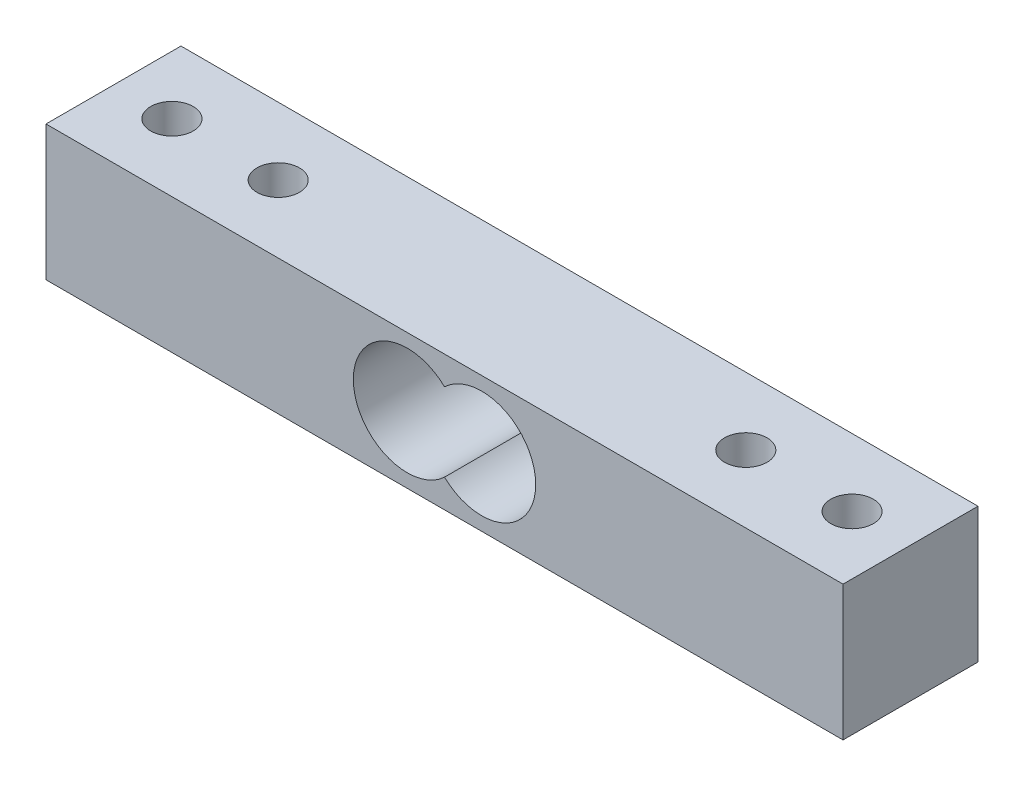
ISO-10303-21;
HEADER;
FILE_DESCRIPTION(('STEP AP214'),'2;1');
FILE_NAME('part.step','',(''),(''),'','','');
FILE_SCHEMA(('AUTOMOTIVE_DESIGN { 1 0 10303 214 1 1 1 1 }'));
ENDSEC;
DATA;
#1=APPLICATION_CONTEXT('core data for automotive mechanical design processes');
#2=APPLICATION_PROTOCOL_DEFINITION('international standard','automotive_design',2000,#1);
#3=PRODUCT_CONTEXT('',#1,'mechanical');
#4=PRODUCT('Part','Part','',(#3));
#5=PRODUCT_RELATED_PRODUCT_CATEGORY('part','',(#4));
#6=PRODUCT_DEFINITION_FORMATION('','',#4);
#7=PRODUCT_DEFINITION_CONTEXT('part definition',#1,'design');
#8=PRODUCT_DEFINITION('design','',#6,#7);
#9=PRODUCT_DEFINITION_SHAPE('','',#8);
#10=(LENGTH_UNIT() NAMED_UNIT(*) SI_UNIT(.MILLI.,.METRE.));
#11=(NAMED_UNIT(*) PLANE_ANGLE_UNIT() SI_UNIT($,.RADIAN.));
#12=(NAMED_UNIT(*) SI_UNIT($,.STERADIAN.) SOLID_ANGLE_UNIT());
#13=UNCERTAINTY_MEASURE_WITH_UNIT(LENGTH_MEASURE(1.E-05),#10,'distance_accuracy_value','');
#14=(GEOMETRIC_REPRESENTATION_CONTEXT(3) GLOBAL_UNCERTAINTY_ASSIGNED_CONTEXT((#13)) GLOBAL_UNIT_ASSIGNED_CONTEXT((#10,
#11,#12)) REPRESENTATION_CONTEXT('',''));
#15=CARTESIAN_POINT('',(0.,0.,0.));
#16=DIRECTION('',(0.,0.,1.));
#17=DIRECTION('',(1.,0.,0.));
#18=AXIS2_PLACEMENT_3D('',#15,#16,#17);
#19=CARTESIAN_POINT('',(0.,0.,6.35));
#20=DIRECTION('',(0.,0.,1.));
#21=DIRECTION('',(1.,0.,0.));
#22=AXIS2_PLACEMENT_3D('',#19,#20,#21);
#23=PLANE('',#22);
#24=DIRECTION('',(0.,-1.,0.));
#25=VECTOR('',#24,1.);
#26=CARTESIAN_POINT('',(-37.5,6.34999999999999,6.35));
#27=LINE('',#26,#25);
#28=CARTESIAN_POINT('',(-37.5,6.34999999999999,6.35));
#29=VERTEX_POINT('',#28);
#30=CARTESIAN_POINT('',(-37.5,-6.35,6.35));
#31=VERTEX_POINT('',#30);
#32=EDGE_CURVE('E110',#29,#31,#27,.T.);
#33=ORIENTED_EDGE('',*,*,#32,.T.);
#34=DIRECTION('',(1.,0.,0.));
#35=VECTOR('',#34,1.);
#36=CARTESIAN_POINT('',(-37.5,-6.35,6.35));
#37=LINE('',#36,#35);
#38=CARTESIAN_POINT('',(37.5,-6.35,6.35));
#39=VERTEX_POINT('',#38);
#40=EDGE_CURVE('E113',#31,#39,#37,.T.);
#41=ORIENTED_EDGE('',*,*,#40,.T.);
#42=DIRECTION('',(0.,1.,0.));
#43=VECTOR('',#42,1.);
#44=CARTESIAN_POINT('',(37.5,6.34999999999999,6.35));
#45=LINE('',#44,#43);
#46=CARTESIAN_POINT('',(37.5,6.34999999999999,6.35));
#47=VERTEX_POINT('',#46);
#48=EDGE_CURVE('E116',#39,#47,#45,.T.);
#49=ORIENTED_EDGE('',*,*,#48,.T.);
#50=DIRECTION('',(-1.,0.,0.));
#51=VECTOR('',#50,1.);
#52=CARTESIAN_POINT('',(-37.5,6.34999999999999,6.35));
#53=LINE('',#52,#51);
#54=EDGE_CURVE('E118',#47,#29,#53,.T.);
#55=ORIENTED_EDGE('',*,*,#54,.T.);
#56=EDGE_LOOP('',(#33,#41,#49,#55));
#57=FACE_BOUND('',#56,.T.);
#58=CARTESIAN_POINT('',(-3.5,0.,6.35));
#59=DIRECTION('',(0.,0.,1.));
#60=DIRECTION('',(1.,0.,0.));
#61=AXIS2_PLACEMENT_3D('',#58,#59,#60);
#62=CIRCLE('',#61,5.08);
#63=CARTESIAN_POINT('',(0.,3.68190168255482,6.35));
#64=VERTEX_POINT('',#63);
#65=CARTESIAN_POINT('',(0.,-3.68190168255482,6.35));
#66=VERTEX_POINT('',#65);
#67=EDGE_CURVE('E89',#64,#66,#62,.T.);
#68=ORIENTED_EDGE('',*,*,#67,.F.);
#69=CARTESIAN_POINT('',(3.5,0.,6.35));
#70=DIRECTION('',(0.,0.,1.));
#71=DIRECTION('',(1.,0.,0.));
#72=AXIS2_PLACEMENT_3D('',#69,#70,#71);
#73=CIRCLE('',#72,5.08);
#74=EDGE_CURVE('E95',#66,#64,#73,.T.);
#75=ORIENTED_EDGE('',*,*,#74,.F.);
#76=EDGE_LOOP('',(#68,#75));
#77=FACE_BOUND('',#76,.T.);
#78=ADVANCED_FACE('F37',(#57,#77),#23,.T.);
#79=CARTESIAN_POINT('',(0.,0.,-6.35));
#80=DIRECTION('',(0.,0.,1.));
#81=DIRECTION('',(1.,0.,0.));
#82=AXIS2_PLACEMENT_3D('',#79,#80,#81);
#83=PLANE('',#82);
#84=DIRECTION('',(0.,-1.,0.));
#85=VECTOR('',#84,1.);
#86=CARTESIAN_POINT('',(-37.5,6.34999999999999,-6.35));
#87=LINE('',#86,#85);
#88=CARTESIAN_POINT('',(-37.5,6.34999999999999,-6.35));
#89=VERTEX_POINT('',#88);
#90=CARTESIAN_POINT('',(-37.5,-6.35,-6.35));
#91=VERTEX_POINT('',#90);
#92=EDGE_CURVE('E109',#89,#91,#87,.T.);
#93=ORIENTED_EDGE('',*,*,#92,.F.);
#94=DIRECTION('',(-1.,0.,0.));
#95=VECTOR('',#94,1.);
#96=CARTESIAN_POINT('',(-37.5,6.34999999999999,-6.35));
#97=LINE('',#96,#95);
#98=CARTESIAN_POINT('',(37.5,6.34999999999999,-6.35));
#99=VERTEX_POINT('',#98);
#100=EDGE_CURVE('E114',#99,#89,#97,.T.);
#101=ORIENTED_EDGE('',*,*,#100,.F.);
#102=DIRECTION('',(0.,1.,0.));
#103=VECTOR('',#102,1.);
#104=CARTESIAN_POINT('',(37.5,6.34999999999999,-6.35));
#105=LINE('',#104,#103);
#106=CARTESIAN_POINT('',(37.5,-6.35,-6.35));
#107=VERTEX_POINT('',#106);
#108=EDGE_CURVE('E125',#107,#99,#105,.T.);
#109=ORIENTED_EDGE('',*,*,#108,.F.);
#110=DIRECTION('',(1.,0.,0.));
#111=VECTOR('',#110,1.);
#112=CARTESIAN_POINT('',(-37.5,-6.35,-6.35));
#113=LINE('',#112,#111);
#114=EDGE_CURVE('E123',#91,#107,#113,.T.);
#115=ORIENTED_EDGE('',*,*,#114,.F.);
#116=EDGE_LOOP('',(#93,#101,#109,#115));
#117=FACE_BOUND('',#116,.T.);
#118=CARTESIAN_POINT('',(3.5,0.,-6.35));
#119=DIRECTION('',(0.,0.,1.));
#120=DIRECTION('',(1.,0.,0.));
#121=AXIS2_PLACEMENT_3D('',#118,#119,#120);
#122=CIRCLE('',#121,5.08);
#123=CARTESIAN_POINT('',(0.,-3.68190168255482,-6.35));
#124=VERTEX_POINT('',#123);
#125=CARTESIAN_POINT('',(0.,3.68190168255482,-6.35));
#126=VERTEX_POINT('',#125);
#127=EDGE_CURVE('E59',#124,#126,#122,.T.);
#128=ORIENTED_EDGE('',*,*,#127,.T.);
#129=CARTESIAN_POINT('',(-3.5,0.,-6.35));
#130=DIRECTION('',(0.,0.,1.));
#131=DIRECTION('',(1.,0.,0.));
#132=AXIS2_PLACEMENT_3D('',#129,#130,#131);
#133=CIRCLE('',#132,5.08);
#134=EDGE_CURVE('E99',#126,#124,#133,.T.);
#135=ORIENTED_EDGE('',*,*,#134,.T.);
#136=EDGE_LOOP('',(#128,#135));
#137=FACE_BOUND('',#136,.T.);
#138=ADVANCED_FACE('F143',(#117,#137),#83,.F.);
#139=CARTESIAN_POINT('',(-37.5,6.34999999999999,6.35));
#140=DIRECTION('',(1.,0.,0.));
#141=DIRECTION('',(0.,0.,-1.));
#142=AXIS2_PLACEMENT_3D('',#139,#140,#141);
#143=PLANE('',#142);
#144=ORIENTED_EDGE('',*,*,#92,.T.);
#145=DIRECTION('',(0.,0.,-1.));
#146=VECTOR('',#145,1.);
#147=CARTESIAN_POINT('',(-37.5,-6.35,6.35));
#148=LINE('',#147,#146);
#149=EDGE_CURVE('E11',#31,#91,#148,.T.);
#150=ORIENTED_EDGE('',*,*,#149,.F.);
#151=ORIENTED_EDGE('',*,*,#32,.F.);
#152=DIRECTION('',(0.,0.,-1.));
#153=VECTOR('',#152,1.);
#154=CARTESIAN_POINT('',(-37.5,6.34999999999999,6.35));
#155=LINE('',#154,#153);
#156=EDGE_CURVE('E120',#29,#89,#155,.T.);
#157=ORIENTED_EDGE('',*,*,#156,.T.);
#158=EDGE_LOOP('',(#144,#150,#151,#157));
#159=FACE_BOUND('',#158,.T.);
#160=ADVANCED_FACE('F39',(#159),#143,.F.);
#161=CARTESIAN_POINT('',(-37.5,-6.35,6.35));
#162=DIRECTION('',(0.,1.,0.));
#163=DIRECTION('',(0.,0.,1.));
#164=AXIS2_PLACEMENT_3D('',#161,#162,#163);
#165=PLANE('',#164);
#166=CARTESIAN_POINT('',(-31.999999942,-6.35,0.));
#167=DIRECTION('',(0.,1.,0.));
#168=DIRECTION('',(0.,0.,1.));
#169=AXIS2_PLACEMENT_3D('',#166,#167,#168);
#170=CIRCLE('',#169,2.);
#171=CARTESIAN_POINT('',(-31.999999942,-6.35,2.));
#172=VERTEX_POINT('',#171);
#173=EDGE_CURVE('E106',#172,#172,#170,.T.);
#174=ORIENTED_EDGE('',*,*,#173,.T.);
#175=EDGE_LOOP('',(#174));
#176=FACE_BOUND('',#175,.T.);
#177=CARTESIAN_POINT('',(21.999999942,-6.35,0.));
#178=DIRECTION('',(0.,1.,0.));
#179=DIRECTION('',(0.,0.,-1.));
#180=AXIS2_PLACEMENT_3D('',#177,#178,#179);
#181=CIRCLE('',#180,2.0000000000047);
#182=CARTESIAN_POINT('',(21.999999942,-6.35,-2.0000000000047));
#183=VERTEX_POINT('',#182);
#184=EDGE_CURVE('E202',#183,#183,#181,.T.);
#185=ORIENTED_EDGE('',*,*,#184,.T.);
#186=EDGE_LOOP('',(#185));
#187=FACE_BOUND('',#186,.T.);
#188=CARTESIAN_POINT('',(31.999999942,-6.35,0.));
#189=DIRECTION('',(0.,1.,0.));
#190=DIRECTION('',(0.,0.,-1.));
#191=AXIS2_PLACEMENT_3D('',#188,#189,#190);
#192=CIRCLE('',#191,2.);
#193=CARTESIAN_POINT('',(31.999999942,-6.35,-2.));
#194=VERTEX_POINT('',#193);
#195=EDGE_CURVE('E198',#194,#194,#192,.T.);
#196=ORIENTED_EDGE('',*,*,#195,.T.);
#197=EDGE_LOOP('',(#196));
#198=FACE_BOUND('',#197,.T.);
#199=CARTESIAN_POINT('',(-21.999999942,-6.35,0.));
#200=DIRECTION('',(0.,1.,0.));
#201=DIRECTION('',(0.,0.,1.));
#202=AXIS2_PLACEMENT_3D('',#199,#200,#201);
#203=CIRCLE('',#202,2.0000000000047);
#204=CARTESIAN_POINT('',(-21.999999942,-6.35,2.0000000000047));
#205=VERTEX_POINT('',#204);
#206=EDGE_CURVE('E192',#205,#205,#203,.T.);
#207=ORIENTED_EDGE('',*,*,#206,.T.);
#208=EDGE_LOOP('',(#207));
#209=FACE_BOUND('',#208,.T.);
#210=ORIENTED_EDGE('',*,*,#114,.T.);
#211=DIRECTION('',(0.,0.,-1.));
#212=VECTOR('',#211,1.);
#213=CARTESIAN_POINT('',(37.5,-6.35,6.35));
#214=LINE('',#213,#212);
#215=EDGE_CURVE('E45',#39,#107,#214,.T.);
#216=ORIENTED_EDGE('',*,*,#215,.F.);
#217=ORIENTED_EDGE('',*,*,#40,.F.);
#218=ORIENTED_EDGE('',*,*,#149,.T.);
#219=EDGE_LOOP('',(#210,#216,#217,#218));
#220=FACE_BOUND('',#219,.T.);
#221=ADVANCED_FACE('F153',(#176,#187,#198,#209,#220),#165,.F.);
#222=CARTESIAN_POINT('',(37.5,6.34999999999999,6.35));
#223=DIRECTION('',(-1.,0.,0.));
#224=DIRECTION('',(0.,-1.,0.));
#225=AXIS2_PLACEMENT_3D('',#222,#223,#224);
#226=PLANE('',#225);
#227=ORIENTED_EDGE('',*,*,#108,.T.);
#228=DIRECTION('',(0.,0.,-1.));
#229=VECTOR('',#228,1.);
#230=CARTESIAN_POINT('',(37.5,6.34999999999999,6.35));
#231=LINE('',#230,#229);
#232=EDGE_CURVE('E130',#47,#99,#231,.T.);
#233=ORIENTED_EDGE('',*,*,#232,.F.);
#234=ORIENTED_EDGE('',*,*,#48,.F.);
#235=ORIENTED_EDGE('',*,*,#215,.T.);
#236=EDGE_LOOP('',(#227,#233,#234,#235));
#237=FACE_BOUND('',#236,.T.);
#238=ADVANCED_FACE('F137',(#237),#226,.F.);
#239=CARTESIAN_POINT('',(-37.5,6.34999999999999,6.35));
#240=DIRECTION('',(0.,-1.,0.));
#241=DIRECTION('',(0.,0.,-1.));
#242=AXIS2_PLACEMENT_3D('',#239,#240,#241);
#243=PLANE('',#242);
#244=CARTESIAN_POINT('',(-31.999999942,6.34999999999999,0.));
#245=DIRECTION('',(0.,1.,0.));
#246=DIRECTION('',(0.,0.,1.));
#247=AXIS2_PLACEMENT_3D('',#244,#245,#246);
#248=CIRCLE('',#247,2.);
#249=CARTESIAN_POINT('',(-31.999999942,6.34999999999999,2.));
#250=VERTEX_POINT('',#249);
#251=EDGE_CURVE('E180',#250,#250,#248,.T.);
#252=ORIENTED_EDGE('',*,*,#251,.F.);
#253=EDGE_LOOP('',(#252));
#254=FACE_BOUND('',#253,.T.);
#255=CARTESIAN_POINT('',(21.999999942,6.34999999999999,0.));
#256=DIRECTION('',(0.,1.,0.));
#257=DIRECTION('',(0.,0.,-1.));
#258=AXIS2_PLACEMENT_3D('',#255,#256,#257);
#259=CIRCLE('',#258,2.0000000000047);
#260=CARTESIAN_POINT('',(21.999999942,6.34999999999999,-2.0000000000047));
#261=VERTEX_POINT('',#260);
#262=EDGE_CURVE('E184',#261,#261,#259,.T.);
#263=ORIENTED_EDGE('',*,*,#262,.F.);
#264=EDGE_LOOP('',(#263));
#265=FACE_BOUND('',#264,.T.);
#266=CARTESIAN_POINT('',(31.999999942,6.34999999999999,0.));
#267=DIRECTION('',(0.,1.,0.));
#268=DIRECTION('',(0.,0.,-1.));
#269=AXIS2_PLACEMENT_3D('',#266,#267,#268);
#270=CIRCLE('',#269,2.);
#271=CARTESIAN_POINT('',(31.999999942,6.34999999999999,-2.));
#272=VERTEX_POINT('',#271);
#273=EDGE_CURVE('E103',#272,#272,#270,.T.);
#274=ORIENTED_EDGE('',*,*,#273,.F.);
#275=EDGE_LOOP('',(#274));
#276=FACE_BOUND('',#275,.T.);
#277=CARTESIAN_POINT('',(-21.999999942,6.34999999999999,0.));
#278=DIRECTION('',(0.,1.,0.));
#279=DIRECTION('',(0.,0.,1.));
#280=AXIS2_PLACEMENT_3D('',#277,#278,#279);
#281=CIRCLE('',#280,2.0000000000047);
#282=CARTESIAN_POINT('',(-21.999999942,6.34999999999999,2.0000000000047));
#283=VERTEX_POINT('',#282);
#284=EDGE_CURVE('E190',#283,#283,#281,.T.);
#285=ORIENTED_EDGE('',*,*,#284,.F.);
#286=EDGE_LOOP('',(#285));
#287=FACE_BOUND('',#286,.T.);
#288=ORIENTED_EDGE('',*,*,#100,.T.);
#289=ORIENTED_EDGE('',*,*,#156,.F.);
#290=ORIENTED_EDGE('',*,*,#54,.F.);
#291=ORIENTED_EDGE('',*,*,#232,.T.);
#292=EDGE_LOOP('',(#288,#289,#290,#291));
#293=FACE_BOUND('',#292,.T.);
#294=ADVANCED_FACE('F147',(#254,#265,#276,#287,#293),#243,.F.);
#295=CARTESIAN_POINT('',(3.5,0.,6.35));
#296=DIRECTION('',(0.,0.,-1.));
#297=DIRECTION('',(-1.,0.,0.));
#298=AXIS2_PLACEMENT_3D('',#295,#296,#297);
#299=CYLINDRICAL_SURFACE('',#298,5.08);
#300=ORIENTED_EDGE('',*,*,#127,.F.);
#301=DIRECTION('',(0.,0.,-1.));
#302=VECTOR('',#301,1.);
#303=CARTESIAN_POINT('',(0.,-3.68190168255482,6.35));
#304=LINE('',#303,#302);
#305=EDGE_CURVE('E91',#66,#124,#304,.T.);
#306=ORIENTED_EDGE('',*,*,#305,.F.);
#307=ORIENTED_EDGE('',*,*,#74,.T.);
#308=DIRECTION('',(0.,0.,-1.));
#309=VECTOR('',#308,1.);
#310=CARTESIAN_POINT('',(0.,3.68190168255482,6.35));
#311=LINE('',#310,#309);
#312=EDGE_CURVE('E52',#64,#126,#311,.T.);
#313=ORIENTED_EDGE('',*,*,#312,.T.);
#314=EDGE_LOOP('',(#300,#306,#307,#313));
#315=FACE_BOUND('',#314,.T.);
#316=ADVANCED_FACE('F97',(#315),#299,.F.);
#317=CARTESIAN_POINT('',(-3.5,0.,6.35));
#318=DIRECTION('',(0.,0.,-1.));
#319=DIRECTION('',(-1.,0.,0.));
#320=AXIS2_PLACEMENT_3D('',#317,#318,#319);
#321=CYLINDRICAL_SURFACE('',#320,5.08);
#322=ORIENTED_EDGE('',*,*,#134,.F.);
#323=ORIENTED_EDGE('',*,*,#312,.F.);
#324=ORIENTED_EDGE('',*,*,#67,.T.);
#325=ORIENTED_EDGE('',*,*,#305,.T.);
#326=EDGE_LOOP('',(#322,#323,#324,#325));
#327=FACE_BOUND('',#326,.T.);
#328=ADVANCED_FACE('F90',(#327),#321,.F.);
#329=CARTESIAN_POINT('',(-21.999999942,-6.35,0.));
#330=DIRECTION('',(0.,1.,0.));
#331=DIRECTION('',(0.,0.,1.));
#332=AXIS2_PLACEMENT_3D('',#329,#330,#331);
#333=CYLINDRICAL_SURFACE('',#332,2.0000000000047);
#334=ORIENTED_EDGE('',*,*,#206,.F.);
#335=EDGE_LOOP('',(#334));
#336=FACE_BOUND('',#335,.T.);
#337=ORIENTED_EDGE('',*,*,#284,.T.);
#338=EDGE_LOOP('',(#337));
#339=FACE_BOUND('',#338,.T.);
#340=ADVANCED_FACE('F221',(#336,#339),#333,.F.);
#341=CARTESIAN_POINT('',(31.999999942,-6.35,0.));
#342=DIRECTION('',(0.,1.,0.));
#343=DIRECTION('',(0.,0.,1.));
#344=AXIS2_PLACEMENT_3D('',#341,#342,#343);
#345=CYLINDRICAL_SURFACE('',#344,2.);
#346=ORIENTED_EDGE('',*,*,#195,.F.);
#347=EDGE_LOOP('',(#346));
#348=FACE_BOUND('',#347,.T.);
#349=ORIENTED_EDGE('',*,*,#273,.T.);
#350=EDGE_LOOP('',(#349));
#351=FACE_BOUND('',#350,.T.);
#352=ADVANCED_FACE('F217',(#348,#351),#345,.F.);
#353=CARTESIAN_POINT('',(21.999999942,-6.35,0.));
#354=DIRECTION('',(0.,1.,0.));
#355=DIRECTION('',(0.,0.,1.));
#356=AXIS2_PLACEMENT_3D('',#353,#354,#355);
#357=CYLINDRICAL_SURFACE('',#356,2.0000000000047);
#358=ORIENTED_EDGE('',*,*,#184,.F.);
#359=EDGE_LOOP('',(#358));
#360=FACE_BOUND('',#359,.T.);
#361=ORIENTED_EDGE('',*,*,#262,.T.);
#362=EDGE_LOOP('',(#361));
#363=FACE_BOUND('',#362,.T.);
#364=ADVANCED_FACE('F212',(#360,#363),#357,.F.);
#365=CARTESIAN_POINT('',(-31.999999942,-6.35,0.));
#366=DIRECTION('',(0.,1.,0.));
#367=DIRECTION('',(0.,0.,1.));
#368=AXIS2_PLACEMENT_3D('',#365,#366,#367);
#369=CYLINDRICAL_SURFACE('',#368,2.);
#370=ORIENTED_EDGE('',*,*,#173,.F.);
#371=EDGE_LOOP('',(#370));
#372=FACE_BOUND('',#371,.T.);
#373=ORIENTED_EDGE('',*,*,#251,.T.);
#374=EDGE_LOOP('',(#373));
#375=FACE_BOUND('',#374,.T.);
#376=ADVANCED_FACE('F209',(#372,#375),#369,.F.);
#377=CLOSED_SHELL('',(#78,#138,#160,#221,#238,#294,#316,#328,#340,#352,#364,#376));
#378=MANIFOLD_SOLID_BREP('B2',#377);
#379=ADVANCED_BREP_SHAPE_REPRESENTATION('',(#18,#378),#14);
#380=SHAPE_DEFINITION_REPRESENTATION(#9,#379);
ENDSEC;
END-ISO-10303-21;
